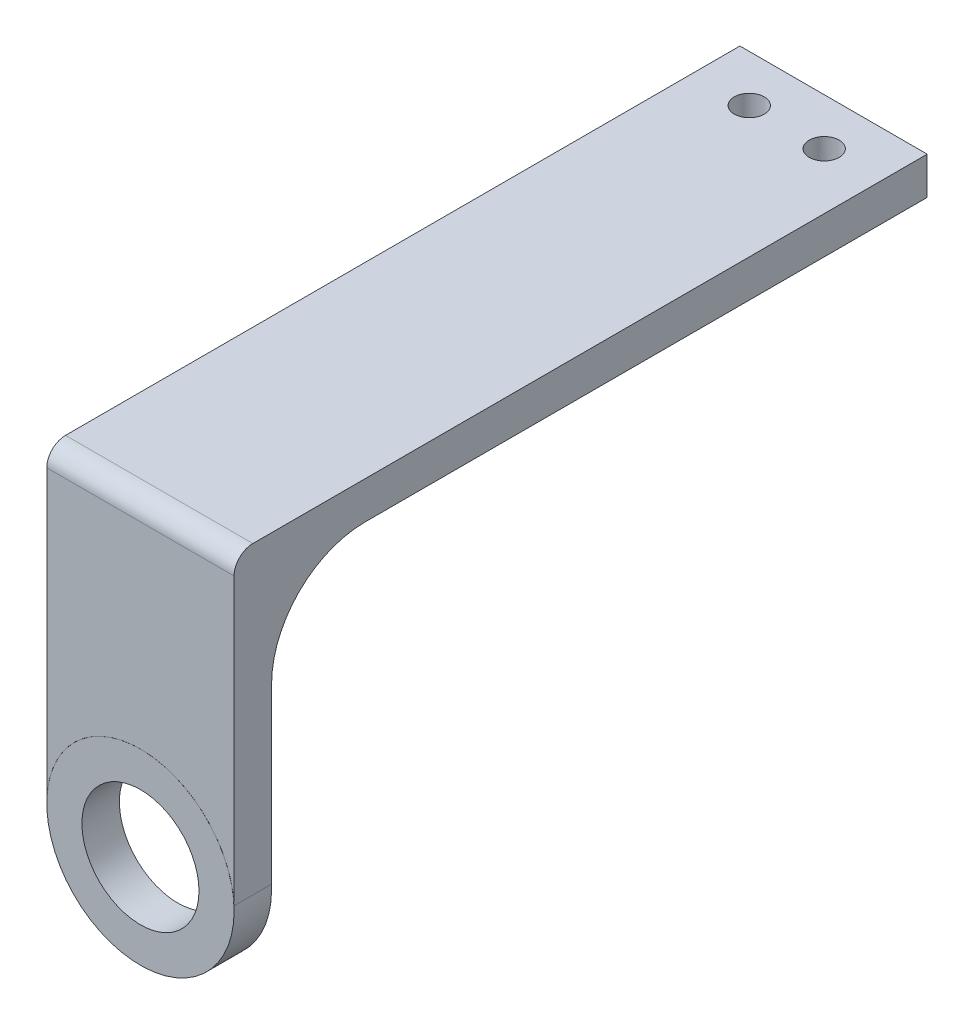
ISO-10303-21;
HEADER;
FILE_DESCRIPTION(('STEP AP214'),'2;1');
FILE_NAME('part.step','',(''),(''),'','','');
FILE_SCHEMA(('AUTOMOTIVE_DESIGN { 1 0 10303 214 1 1 1 1 }'));
ENDSEC;
DATA;
#1=APPLICATION_CONTEXT('core data for automotive mechanical design processes');
#2=APPLICATION_PROTOCOL_DEFINITION('international standard','automotive_design',2000,#1);
#3=PRODUCT_CONTEXT('',#1,'mechanical');
#4=PRODUCT('Part','Part','',(#3));
#5=PRODUCT_RELATED_PRODUCT_CATEGORY('part','',(#4));
#6=PRODUCT_DEFINITION_FORMATION('','',#4);
#7=PRODUCT_DEFINITION_CONTEXT('part definition',#1,'design');
#8=PRODUCT_DEFINITION('design','',#6,#7);
#9=PRODUCT_DEFINITION_SHAPE('','',#8);
#10=(LENGTH_UNIT() NAMED_UNIT(*) SI_UNIT(.MILLI.,.METRE.));
#11=(NAMED_UNIT(*) PLANE_ANGLE_UNIT() SI_UNIT($,.RADIAN.));
#12=(NAMED_UNIT(*) SI_UNIT($,.STERADIAN.) SOLID_ANGLE_UNIT());
#13=UNCERTAINTY_MEASURE_WITH_UNIT(LENGTH_MEASURE(1.E-05),#10,'distance_accuracy_value','');
#14=(GEOMETRIC_REPRESENTATION_CONTEXT(3) GLOBAL_UNCERTAINTY_ASSIGNED_CONTEXT((#13)) GLOBAL_UNIT_ASSIGNED_CONTEXT((#10,
#11,#12)) REPRESENTATION_CONTEXT('',''));
#15=CARTESIAN_POINT('',(0.,0.,0.));
#16=DIRECTION('',(0.,0.,1.));
#17=DIRECTION('',(1.,0.,0.));
#18=AXIS2_PLACEMENT_3D('',#15,#16,#17);
#19=CARTESIAN_POINT('',(0.,0.,4.));
#20=DIRECTION('',(0.,0.,-1.));
#21=DIRECTION('',(-1.,0.,0.));
#22=AXIS2_PLACEMENT_3D('',#19,#20,#21);
#23=CYLINDRICAL_SURFACE('',#22,6.25);
#24=CARTESIAN_POINT('',(0.,0.,4.));
#25=DIRECTION('',(0.,0.,1.));
#26=DIRECTION('',(1.,0.,0.));
#27=AXIS2_PLACEMENT_3D('',#24,#25,#26);
#28=CIRCLE('',#27,6.25);
#29=CARTESIAN_POINT('',(6.25,0.,4.));
#30=VERTEX_POINT('',#29);
#31=EDGE_CURVE('E65',#30,#30,#28,.T.);
#32=ORIENTED_EDGE('',*,*,#31,.T.);
#33=EDGE_LOOP('',(#32));
#34=FACE_BOUND('',#33,.T.);
#35=CARTESIAN_POINT('',(0.,0.,0.));
#36=DIRECTION('',(0.,0.,1.));
#37=DIRECTION('',(1.,0.,0.));
#38=AXIS2_PLACEMENT_3D('',#35,#36,#37);
#39=CIRCLE('',#38,6.25);
#40=CARTESIAN_POINT('',(6.25,0.,0.));
#41=VERTEX_POINT('',#40);
#42=EDGE_CURVE('E71',#41,#41,#39,.T.);
#43=ORIENTED_EDGE('',*,*,#42,.F.);
#44=EDGE_LOOP('',(#43));
#45=FACE_BOUND('',#44,.T.);
#46=ADVANCED_FACE('F58',(#34,#45),#23,.F.);
#47=CARTESIAN_POINT('',(0.,0.,4.));
#48=DIRECTION('',(0.,0.,-1.));
#49=DIRECTION('',(-1.,0.,0.));
#50=AXIS2_PLACEMENT_3D('',#47,#48,#49);
#51=CYLINDRICAL_SURFACE('',#50,10.);
#52=CARTESIAN_POINT('',(0.,0.,4.));
#53=DIRECTION('',(0.,0.,1.));
#54=DIRECTION('',(1.,0.,0.));
#55=AXIS2_PLACEMENT_3D('',#52,#53,#54);
#56=CIRCLE('',#55,10.);
#57=CARTESIAN_POINT('',(10.,0.,4.));
#58=VERTEX_POINT('',#57);
#59=EDGE_CURVE('E12',#58,#58,#56,.T.);
#60=ORIENTED_EDGE('',*,*,#59,.F.);
#61=EDGE_LOOP('',(#60));
#62=FACE_BOUND('',#61,.T.);
#63=CARTESIAN_POINT('',(0.,0.,0.));
#64=DIRECTION('',(0.,0.,1.));
#65=DIRECTION('',(1.,0.,0.));
#66=AXIS2_PLACEMENT_3D('',#63,#64,#65);
#67=CIRCLE('',#66,10.);
#68=CARTESIAN_POINT('',(10.,0.,0.));
#69=VERTEX_POINT('',#68);
#70=EDGE_CURVE('E61',#69,#69,#67,.T.);
#71=ORIENTED_EDGE('',*,*,#70,.T.);
#72=EDGE_LOOP('',(#71));
#73=FACE_BOUND('',#72,.T.);
#74=ADVANCED_FACE('F78',(#62,#73),#51,.T.);
#75=CARTESIAN_POINT('',(0.,0.,4.));
#76=DIRECTION('',(0.,0.,1.));
#77=DIRECTION('',(1.,0.,0.));
#78=AXIS2_PLACEMENT_3D('',#75,#76,#77);
#79=PLANE('',#78);
#80=ORIENTED_EDGE('',*,*,#31,.F.);
#81=EDGE_LOOP('',(#80));
#82=FACE_BOUND('',#81,.T.);
#83=ORIENTED_EDGE('',*,*,#59,.T.);
#84=EDGE_LOOP('',(#83));
#85=FACE_BOUND('',#84,.T.);
#86=ADVANCED_FACE('F82',(#82,#85),#79,.T.);
#87=CARTESIAN_POINT('',(0.,0.,0.));
#88=DIRECTION('',(0.,0.,1.));
#89=DIRECTION('',(1.,0.,0.));
#90=AXIS2_PLACEMENT_3D('',#87,#88,#89);
#91=PLANE('',#90);
#92=ORIENTED_EDGE('',*,*,#42,.T.);
#93=EDGE_LOOP('',(#92));
#94=FACE_BOUND('',#93,.T.);
#95=ORIENTED_EDGE('',*,*,#70,.F.);
#96=EDGE_LOOP('',(#95));
#97=FACE_BOUND('',#96,.T.);
#98=ADVANCED_FACE('F80',(#94,#97),#91,.F.);
#99=CLOSED_SHELL('',(#46,#74,#86,#98));
#100=MANIFOLD_SOLID_BREP('B2',#99);
#101=CARTESIAN_POINT('',(0.,0.,0.));
#102=DIRECTION('',(0.,0.,1.));
#103=DIRECTION('',(1.,0.,0.));
#104=AXIS2_PLACEMENT_3D('',#101,#102,#103);
#105=PLANE('',#104);
#106=DIRECTION('',(0.,1.,0.));
#107=VECTOR('',#106,1.);
#108=CARTESIAN_POINT('',(-10.,0.,0.));
#109=LINE('',#108,#107);
#110=CARTESIAN_POINT('',(-10.,0.,0.));
#111=VERTEX_POINT('',#110);
#112=CARTESIAN_POINT('',(-10.,19.,0.));
#113=VERTEX_POINT('',#112);
#114=EDGE_CURVE('E210',#111,#113,#109,.T.);
#115=ORIENTED_EDGE('',*,*,#114,.T.);
#116=DIRECTION('',(-1.,0.,0.));
#117=VECTOR('',#116,1.);
#118=CARTESIAN_POINT('',(10.,19.,0.));
#119=LINE('',#118,#117);
#120=CARTESIAN_POINT('',(10.,19.,0.));
#121=VERTEX_POINT('',#120);
#122=EDGE_CURVE('E246',#113,#121,#119,.F.);
#123=ORIENTED_EDGE('',*,*,#122,.T.);
#124=DIRECTION('',(0.,-1.,0.));
#125=VECTOR('',#124,1.);
#126=CARTESIAN_POINT('',(10.,0.,0.));
#127=LINE('',#126,#125);
#128=CARTESIAN_POINT('',(10.,0.502965572990381,0.));
#129=VERTEX_POINT('',#128);
#130=EDGE_CURVE('E221',#121,#129,#127,.T.);
#131=ORIENTED_EDGE('',*,*,#130,.T.);
#132=CARTESIAN_POINT('',(0.00632435919033856,0.,0.));
#133=DIRECTION('',(0.,0.,1.));
#134=DIRECTION('',(1.,0.,0.));
#135=AXIS2_PLACEMENT_3D('',#132,#133,#134);
#136=CIRCLE('',#135,10.0063243591903);
#137=EDGE_CURVE('E213',#111,#129,#136,.F.);
#138=ORIENTED_EDGE('',*,*,#137,.F.);
#139=EDGE_LOOP('',(#115,#123,#131,#138));
#140=FACE_BOUND('',#139,.T.);
#141=ADVANCED_FACE('F120',(#140),#105,.F.);
#142=CARTESIAN_POINT('',(-10.,0.,4.));
#143=DIRECTION('',(-1.,0.,0.));
#144=DIRECTION('',(0.,0.,1.));
#145=AXIS2_PLACEMENT_3D('',#142,#143,#144);
#146=PLANE('',#145);
#147=DIRECTION('',(0.,1.,0.));
#148=VECTOR('',#147,1.);
#149=CARTESIAN_POINT('',(-10.,0.,4.));
#150=LINE('',#149,#148);
#151=CARTESIAN_POINT('',(-10.,0.,4.));
#152=VERTEX_POINT('',#151);
#153=CARTESIAN_POINT('',(-10.,31.,4.));
#154=VERTEX_POINT('',#153);
#155=EDGE_CURVE('E218',#152,#154,#150,.T.);
#156=ORIENTED_EDGE('',*,*,#155,.T.);
#157=CARTESIAN_POINT('',(-10.,31.,2.));
#158=DIRECTION('',(-1.,0.,0.));
#159=DIRECTION('',(0.,0.,1.));
#160=AXIS2_PLACEMENT_3D('',#157,#158,#159);
#161=CIRCLE('',#160,2.);
#162=CARTESIAN_POINT('',(-10.,33.,2.));
#163=VERTEX_POINT('',#162);
#164=EDGE_CURVE('E56',#154,#163,#161,.T.);
#165=ORIENTED_EDGE('',*,*,#164,.T.);
#166=DIRECTION('',(0.,0.,-1.));
#167=VECTOR('',#166,1.);
#168=CARTESIAN_POINT('',(-10.,33.,4.));
#169=LINE('',#168,#167);
#170=CARTESIAN_POINT('',(-10.,33.,-70.));
#171=VERTEX_POINT('',#170);
#172=EDGE_CURVE('E225',#163,#171,#169,.T.);
#173=ORIENTED_EDGE('',*,*,#172,.T.);
#174=DIRECTION('',(0.,1.,0.));
#175=VECTOR('',#174,1.);
#176=CARTESIAN_POINT('',(-10.,0.,-70.));
#177=LINE('',#176,#175);
#178=CARTESIAN_POINT('',(-10.,29.,-70.));
#179=VERTEX_POINT('',#178);
#180=EDGE_CURVE('E196',#179,#171,#177,.T.);
#181=ORIENTED_EDGE('',*,*,#180,.F.);
#182=DIRECTION('',(0.,0.,1.));
#183=VECTOR('',#182,1.);
#184=CARTESIAN_POINT('',(-10.,29.,-70.));
#185=LINE('',#184,#183);
#186=CARTESIAN_POINT('',(-10.,29.,-10.));
#187=VERTEX_POINT('',#186);
#188=EDGE_CURVE('E192',#179,#187,#185,.T.);
#189=ORIENTED_EDGE('',*,*,#188,.T.);
#190=CARTESIAN_POINT('',(-10.,19.,-10.));
#191=DIRECTION('',(-1.,0.,0.));
#192=DIRECTION('',(0.,0.,1.));
#193=AXIS2_PLACEMENT_3D('',#190,#191,#192);
#194=CIRCLE('',#193,10.);
#195=EDGE_CURVE('E248',#187,#113,#194,.F.);
#196=ORIENTED_EDGE('',*,*,#195,.T.);
#197=ORIENTED_EDGE('',*,*,#114,.F.);
#198=DIRECTION('',(0.,0.,-1.));
#199=VECTOR('',#198,1.);
#200=CARTESIAN_POINT('',(-10.,0.,4.));
#201=LINE('',#200,#199);
#202=EDGE_CURVE('E236',#152,#111,#201,.T.);
#203=ORIENTED_EDGE('',*,*,#202,.F.);
#204=EDGE_LOOP('',(#156,#165,#173,#181,#189,#196,#197,#203));
#205=FACE_BOUND('',#204,.T.);
#206=ADVANCED_FACE('F261',(#205),#146,.T.);
#207=CARTESIAN_POINT('',(0.00632435919033856,0.,4.));
#208=DIRECTION('',(0.,0.,-1.));
#209=DIRECTION('',(-1.,0.,0.));
#210=AXIS2_PLACEMENT_3D('',#207,#208,#209);
#211=CYLINDRICAL_SURFACE('',#210,10.0063243591903);
#212=ORIENTED_EDGE('',*,*,#137,.T.);
#213=DIRECTION('',(0.,0.,-1.));
#214=VECTOR('',#213,1.);
#215=CARTESIAN_POINT('',(10.,0.502965572990381,4.));
#216=LINE('',#215,#214);
#217=CARTESIAN_POINT('',(10.,0.502965572990381,4.));
#218=VERTEX_POINT('',#217);
#219=EDGE_CURVE('E233',#218,#129,#216,.T.);
#220=ORIENTED_EDGE('',*,*,#219,.F.);
#221=CARTESIAN_POINT('',(0.00632435919033856,0.,4.));
#222=DIRECTION('',(0.,0.,1.));
#223=DIRECTION('',(1.,0.,0.));
#224=AXIS2_PLACEMENT_3D('',#221,#222,#223);
#225=CIRCLE('',#224,10.0063243591903);
#226=EDGE_CURVE('E220',#152,#218,#225,.F.);
#227=ORIENTED_EDGE('',*,*,#226,.F.);
#228=ORIENTED_EDGE('',*,*,#202,.T.);
#229=EDGE_LOOP('',(#212,#220,#227,#228));
#230=FACE_BOUND('',#229,.T.);
#231=ADVANCED_FACE('F267',(#230),#211,.F.);
#232=CARTESIAN_POINT('',(10.,0.,4.));
#233=DIRECTION('',(1.,0.,0.));
#234=DIRECTION('',(0.,1.,0.));
#235=AXIS2_PLACEMENT_3D('',#232,#233,#234);
#236=PLANE('',#235);
#237=DIRECTION('',(0.,0.,-1.));
#238=VECTOR('',#237,1.);
#239=CARTESIAN_POINT('',(10.,33.,4.));
#240=LINE('',#239,#238);
#241=CARTESIAN_POINT('',(10.,33.,2.));
#242=VERTEX_POINT('',#241);
#243=CARTESIAN_POINT('',(10.,33.,-70.));
#244=VERTEX_POINT('',#243);
#245=EDGE_CURVE('E231',#242,#244,#240,.T.);
#246=ORIENTED_EDGE('',*,*,#245,.F.);
#247=CARTESIAN_POINT('',(10.,31.,2.));
#248=DIRECTION('',(1.,0.,0.));
#249=DIRECTION('',(0.,1.,0.));
#250=AXIS2_PLACEMENT_3D('',#247,#248,#249);
#251=CIRCLE('',#250,2.);
#252=CARTESIAN_POINT('',(10.,31.,4.));
#253=VERTEX_POINT('',#252);
#254=EDGE_CURVE('E142',#242,#253,#251,.T.);
#255=ORIENTED_EDGE('',*,*,#254,.T.);
#256=DIRECTION('',(0.,-1.,0.));
#257=VECTOR('',#256,1.);
#258=CARTESIAN_POINT('',(10.,0.,4.));
#259=LINE('',#258,#257);
#260=EDGE_CURVE('E224',#253,#218,#259,.T.);
#261=ORIENTED_EDGE('',*,*,#260,.T.);
#262=ORIENTED_EDGE('',*,*,#219,.T.);
#263=ORIENTED_EDGE('',*,*,#130,.F.);
#264=CARTESIAN_POINT('',(10.,19.,-10.));
#265=DIRECTION('',(1.,0.,0.));
#266=DIRECTION('',(0.,1.,0.));
#267=AXIS2_PLACEMENT_3D('',#264,#265,#266);
#268=CIRCLE('',#267,10.);
#269=CARTESIAN_POINT('',(10.,29.,-10.));
#270=VERTEX_POINT('',#269);
#271=EDGE_CURVE('E209',#121,#270,#268,.F.);
#272=ORIENTED_EDGE('',*,*,#271,.T.);
#273=DIRECTION('',(0.,0.,1.));
#274=VECTOR('',#273,1.);
#275=CARTESIAN_POINT('',(10.,29.,-70.));
#276=LINE('',#275,#274);
#277=CARTESIAN_POINT('',(10.,29.,-70.));
#278=VERTEX_POINT('',#277);
#279=EDGE_CURVE('E189',#278,#270,#276,.T.);
#280=ORIENTED_EDGE('',*,*,#279,.F.);
#281=DIRECTION('',(0.,-1.,0.));
#282=VECTOR('',#281,1.);
#283=CARTESIAN_POINT('',(10.,0.,-70.));
#284=LINE('',#283,#282);
#285=EDGE_CURVE('E197',#244,#278,#284,.T.);
#286=ORIENTED_EDGE('',*,*,#285,.F.);
#287=EDGE_LOOP('',(#246,#255,#261,#262,#263,#272,#280,#286));
#288=FACE_BOUND('',#287,.T.);
#289=ADVANCED_FACE('F206',(#288),#236,.T.);
#290=CARTESIAN_POINT('',(0.,33.,4.));
#291=DIRECTION('',(0.,1.,0.));
#292=DIRECTION('',(0.,0.,1.));
#293=AXIS2_PLACEMENT_3D('',#290,#291,#292);
#294=PLANE('',#293);
#295=CARTESIAN_POINT('',(-4.,33.,-65.));
#296=DIRECTION('',(0.,1.,0.));
#297=DIRECTION('',(0.,0.,1.));
#298=AXIS2_PLACEMENT_3D('',#295,#296,#297);
#299=CIRCLE('',#298,1.6);
#300=CARTESIAN_POINT('',(-4.,33.,-63.4));
#301=VERTEX_POINT('',#300);
#302=EDGE_CURVE('E242',#301,#301,#299,.T.);
#303=ORIENTED_EDGE('',*,*,#302,.F.);
#304=EDGE_LOOP('',(#303));
#305=FACE_BOUND('',#304,.T.);
#306=CARTESIAN_POINT('',(4.,33.,-65.));
#307=DIRECTION('',(0.,1.,0.));
#308=DIRECTION('',(0.,0.,1.));
#309=AXIS2_PLACEMENT_3D('',#306,#307,#308);
#310=CIRCLE('',#309,1.6);
#311=CARTESIAN_POINT('',(4.,33.,-63.4));
#312=VERTEX_POINT('',#311);
#313=EDGE_CURVE('E275',#312,#312,#310,.T.);
#314=ORIENTED_EDGE('',*,*,#313,.F.);
#315=EDGE_LOOP('',(#314));
#316=FACE_BOUND('',#315,.T.);
#317=ORIENTED_EDGE('',*,*,#172,.F.);
#318=DIRECTION('',(1.,0.,0.));
#319=VECTOR('',#318,1.);
#320=CARTESIAN_POINT('',(0.,33.,2.));
#321=LINE('',#320,#319);
#322=EDGE_CURVE('E251',#163,#242,#321,.T.);
#323=ORIENTED_EDGE('',*,*,#322,.T.);
#324=ORIENTED_EDGE('',*,*,#245,.T.);
#325=DIRECTION('',(1.,0.,0.));
#326=VECTOR('',#325,1.);
#327=CARTESIAN_POINT('',(0.,33.,-70.));
#328=LINE('',#327,#326);
#329=EDGE_CURVE('E203',#171,#244,#328,.T.);
#330=ORIENTED_EDGE('',*,*,#329,.F.);
#331=EDGE_LOOP('',(#317,#323,#324,#330));
#332=FACE_BOUND('',#331,.T.);
#333=ADVANCED_FACE('F257',(#305,#316,#332),#294,.T.);
#334=CARTESIAN_POINT('',(0.,0.,4.));
#335=DIRECTION('',(0.,0.,1.));
#336=DIRECTION('',(1.,0.,0.));
#337=AXIS2_PLACEMENT_3D('',#334,#335,#336);
#338=PLANE('',#337);
#339=ORIENTED_EDGE('',*,*,#260,.F.);
#340=DIRECTION('',(1.,0.,0.));
#341=VECTOR('',#340,1.);
#342=CARTESIAN_POINT('',(0.,31.,4.));
#343=LINE('',#342,#341);
#344=EDGE_CURVE('E128',#253,#154,#343,.F.);
#345=ORIENTED_EDGE('',*,*,#344,.T.);
#346=ORIENTED_EDGE('',*,*,#155,.F.);
#347=ORIENTED_EDGE('',*,*,#226,.T.);
#348=EDGE_LOOP('',(#339,#345,#346,#347));
#349=FACE_BOUND('',#348,.T.);
#350=ADVANCED_FACE('F264',(#349),#338,.T.);
#351=CARTESIAN_POINT('',(0.,29.,-70.));
#352=DIRECTION('',(0.,1.,0.));
#353=DIRECTION('',(0.,0.,1.));
#354=AXIS2_PLACEMENT_3D('',#351,#352,#353);
#355=PLANE('',#354);
#356=CARTESIAN_POINT('',(-4.,29.,-65.));
#357=DIRECTION('',(0.,1.,0.));
#358=DIRECTION('',(0.,0.,1.));
#359=AXIS2_PLACEMENT_3D('',#356,#357,#358);
#360=CIRCLE('',#359,1.6);
#361=CARTESIAN_POINT('',(-4.,29.,-63.4));
#362=VERTEX_POINT('',#361);
#363=EDGE_CURVE('E204',#362,#362,#360,.T.);
#364=ORIENTED_EDGE('',*,*,#363,.T.);
#365=EDGE_LOOP('',(#364));
#366=FACE_BOUND('',#365,.T.);
#367=CARTESIAN_POINT('',(4.,29.,-65.));
#368=DIRECTION('',(0.,1.,0.));
#369=DIRECTION('',(0.,0.,1.));
#370=AXIS2_PLACEMENT_3D('',#367,#368,#369);
#371=CIRCLE('',#370,1.6);
#372=CARTESIAN_POINT('',(4.,29.,-63.4));
#373=VERTEX_POINT('',#372);
#374=EDGE_CURVE('E239',#373,#373,#371,.T.);
#375=ORIENTED_EDGE('',*,*,#374,.T.);
#376=EDGE_LOOP('',(#375));
#377=FACE_BOUND('',#376,.T.);
#378=ORIENTED_EDGE('',*,*,#279,.T.);
#379=DIRECTION('',(-1.,0.,0.));
#380=VECTOR('',#379,1.);
#381=CARTESIAN_POINT('',(-10.,29.,-10.));
#382=LINE('',#381,#380);
#383=EDGE_CURVE('E238',#270,#187,#382,.T.);
#384=ORIENTED_EDGE('',*,*,#383,.T.);
#385=ORIENTED_EDGE('',*,*,#188,.F.);
#386=DIRECTION('',(-1.,0.,0.));
#387=VECTOR('',#386,1.);
#388=CARTESIAN_POINT('',(0.,29.,-70.));
#389=LINE('',#388,#387);
#390=EDGE_CURVE('E184',#278,#179,#389,.T.);
#391=ORIENTED_EDGE('',*,*,#390,.F.);
#392=EDGE_LOOP('',(#378,#384,#385,#391));
#393=FACE_BOUND('',#392,.T.);
#394=ADVANCED_FACE('F186',(#366,#377,#393),#355,.F.);
#395=CARTESIAN_POINT('',(0.,0.,-70.));
#396=DIRECTION('',(0.,0.,-1.));
#397=DIRECTION('',(-1.,0.,0.));
#398=AXIS2_PLACEMENT_3D('',#395,#396,#397);
#399=PLANE('',#398);
#400=ORIENTED_EDGE('',*,*,#285,.T.);
#401=ORIENTED_EDGE('',*,*,#390,.T.);
#402=ORIENTED_EDGE('',*,*,#180,.T.);
#403=ORIENTED_EDGE('',*,*,#329,.T.);
#404=EDGE_LOOP('',(#400,#401,#402,#403));
#405=FACE_BOUND('',#404,.T.);
#406=ADVANCED_FACE('F201',(#405),#399,.T.);
#407=CARTESIAN_POINT('',(4.,23.,-65.));
#408=DIRECTION('',(0.,1.,0.));
#409=DIRECTION('',(0.,0.,1.));
#410=AXIS2_PLACEMENT_3D('',#407,#408,#409);
#411=CYLINDRICAL_SURFACE('',#410,1.6);
#412=ORIENTED_EDGE('',*,*,#313,.T.);
#413=EDGE_LOOP('',(#412));
#414=FACE_BOUND('',#413,.T.);
#415=ORIENTED_EDGE('',*,*,#374,.F.);
#416=EDGE_LOOP('',(#415));
#417=FACE_BOUND('',#416,.T.);
#418=ADVANCED_FACE('F289',(#414,#417),#411,.F.);
#419=CARTESIAN_POINT('',(-4.,23.,-65.));
#420=DIRECTION('',(0.,1.,0.));
#421=DIRECTION('',(0.,0.,1.));
#422=AXIS2_PLACEMENT_3D('',#419,#420,#421);
#423=CYLINDRICAL_SURFACE('',#422,1.6);
#424=ORIENTED_EDGE('',*,*,#302,.T.);
#425=EDGE_LOOP('',(#424));
#426=FACE_BOUND('',#425,.T.);
#427=ORIENTED_EDGE('',*,*,#363,.F.);
#428=EDGE_LOOP('',(#427));
#429=FACE_BOUND('',#428,.T.);
#430=ADVANCED_FACE('F281',(#426,#429),#423,.F.);
#431=CARTESIAN_POINT('',(0.,19.,-10.));
#432=DIRECTION('',(1.,0.,0.));
#433=DIRECTION('',(0.,0.,-1.));
#434=AXIS2_PLACEMENT_3D('',#431,#432,#433);
#435=CYLINDRICAL_SURFACE('',#434,10.);
#436=ORIENTED_EDGE('',*,*,#271,.F.);
#437=ORIENTED_EDGE('',*,*,#122,.F.);
#438=ORIENTED_EDGE('',*,*,#195,.F.);
#439=ORIENTED_EDGE('',*,*,#383,.F.);
#440=EDGE_LOOP('',(#436,#437,#438,#439));
#441=FACE_BOUND('',#440,.T.);
#442=ADVANCED_FACE('F272',(#441),#435,.F.);
#443=CARTESIAN_POINT('',(0.,31.,2.));
#444=DIRECTION('',(1.,0.,0.));
#445=DIRECTION('',(0.,0.,-1.));
#446=AXIS2_PLACEMENT_3D('',#443,#444,#445);
#447=CYLINDRICAL_SURFACE('',#446,2.);
#448=ORIENTED_EDGE('',*,*,#164,.F.);
#449=ORIENTED_EDGE('',*,*,#344,.F.);
#450=ORIENTED_EDGE('',*,*,#254,.F.);
#451=ORIENTED_EDGE('',*,*,#322,.F.);
#452=EDGE_LOOP('',(#448,#449,#450,#451));
#453=FACE_BOUND('',#452,.T.);
#454=ADVANCED_FACE('F122',(#453),#447,.T.);
#455=CLOSED_SHELL('',(#141,#206,#231,#289,#333,#350,#394,#406,#418,#430,#442,#454));
#456=MANIFOLD_SOLID_BREP('B7',#455);
#457=ADVANCED_BREP_SHAPE_REPRESENTATION('',(#18,#100,#456),#14);
#458=SHAPE_DEFINITION_REPRESENTATION(#9,#457);
ENDSEC;
END-ISO-10303-21;
